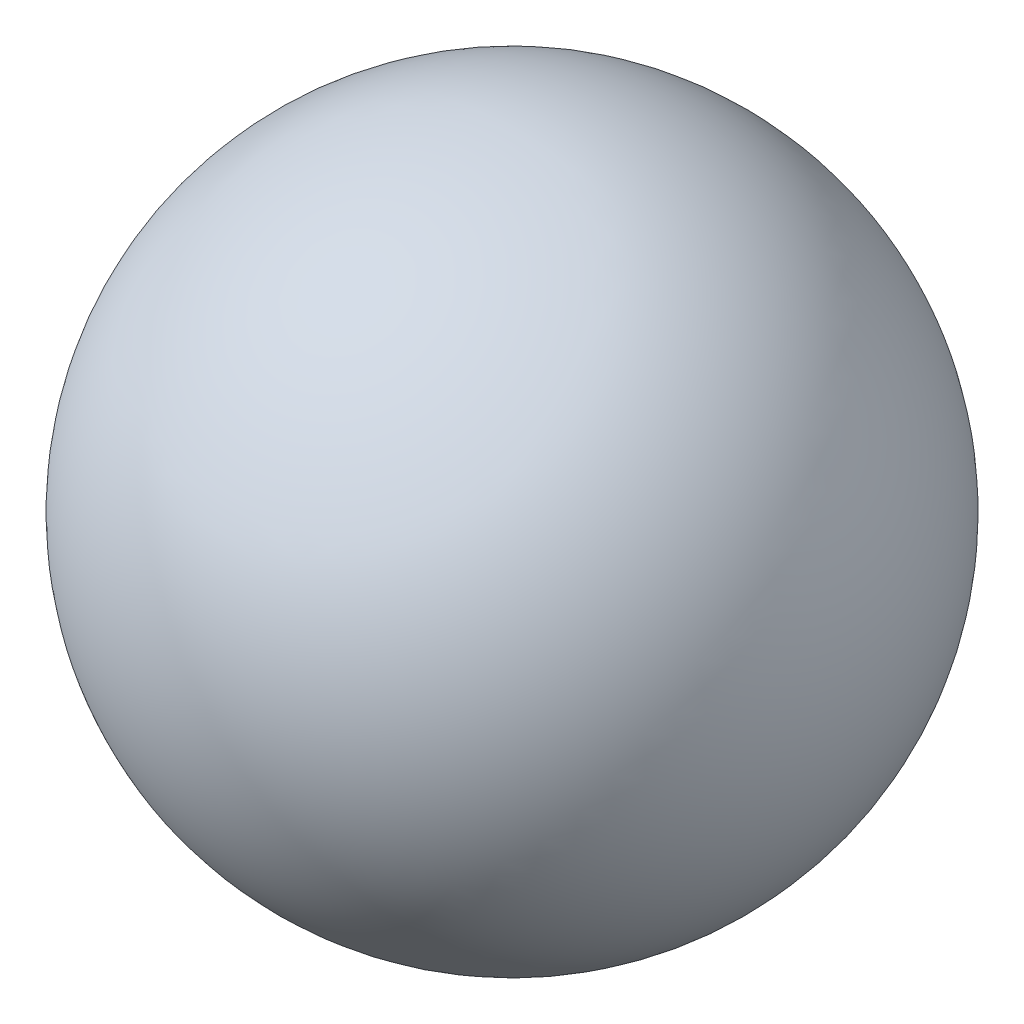
ISO-10303-21;
HEADER;
FILE_DESCRIPTION(('STEP AP214'),'2;1');
FILE_NAME('part.step','',(''),(''),'','','');
FILE_SCHEMA(('AUTOMOTIVE_DESIGN { 1 0 10303 214 1 1 1 1 }'));
ENDSEC;
DATA;
#1=APPLICATION_CONTEXT('core data for automotive mechanical design processes');
#2=APPLICATION_PROTOCOL_DEFINITION('international standard','automotive_design',2000,#1);
#3=PRODUCT_CONTEXT('',#1,'mechanical');
#4=PRODUCT('Part','Part','',(#3));
#5=PRODUCT_RELATED_PRODUCT_CATEGORY('part','',(#4));
#6=PRODUCT_DEFINITION_FORMATION('','',#4);
#7=PRODUCT_DEFINITION_CONTEXT('part definition',#1,'design');
#8=PRODUCT_DEFINITION('design','',#6,#7);
#9=PRODUCT_DEFINITION_SHAPE('','',#8);
#10=(LENGTH_UNIT() NAMED_UNIT(*) SI_UNIT(.MILLI.,.METRE.));
#11=(NAMED_UNIT(*) PLANE_ANGLE_UNIT() SI_UNIT($,.RADIAN.));
#12=(NAMED_UNIT(*) SI_UNIT($,.STERADIAN.) SOLID_ANGLE_UNIT());
#13=UNCERTAINTY_MEASURE_WITH_UNIT(LENGTH_MEASURE(1.E-05),#10,'distance_accuracy_value','');
#14=(GEOMETRIC_REPRESENTATION_CONTEXT(3) GLOBAL_UNCERTAINTY_ASSIGNED_CONTEXT((#13)) GLOBAL_UNIT_ASSIGNED_CONTEXT((#10,
#11,#12)) REPRESENTATION_CONTEXT('',''));
#15=CARTESIAN_POINT('',(0.,0.,0.));
#16=DIRECTION('',(0.,0.,1.));
#17=DIRECTION('',(1.,0.,0.));
#18=AXIS2_PLACEMENT_3D('',#15,#16,#17);
#19=CARTESIAN_POINT('',(0.,0.,0.));
#20=DIRECTION('',(0.,0.,1.));
#21=DIRECTION('',(-1.,0.,0.));
#22=AXIS2_PLACEMENT_3D('',#19,#20,#21);
#23=SPHERICAL_SURFACE('',#22,39.);
#24=CARTESIAN_POINT('',(0.,0.,-37.5599520766467));
#25=DIRECTION('',(0.,0.,1.));
#26=DIRECTION('',(1.,0.,0.));
#27=AXIS2_PLACEMENT_3D('',#24,#25,#26);
#28=CIRCLE('',#27,10.5);
#29=CARTESIAN_POINT('',(10.5,0.,-37.5599520766467));
#30=VERTEX_POINT('',#29);
#31=EDGE_CURVE('E10',#30,#30,#28,.T.);
#32=ORIENTED_EDGE('',*,*,#31,.T.);
#33=EDGE_LOOP('',(#32));
#34=FACE_BOUND('',#33,.T.);
#35=ADVANCED_FACE('F39',(#34),#23,.T.);
#36=CARTESIAN_POINT('',(0.,0.,-151.));
#37=DIRECTION('',(0.,0.,1.));
#38=DIRECTION('',(1.,0.,0.));
#39=AXIS2_PLACEMENT_3D('',#36,#37,#38);
#40=CYLINDRICAL_SURFACE('',#39,10.5);
#41=CARTESIAN_POINT('',(0.,0.,0.));
#42=DIRECTION('',(0.,0.,1.));
#43=DIRECTION('',(1.,0.,0.));
#44=AXIS2_PLACEMENT_3D('',#41,#42,#43);
#45=CIRCLE('',#44,10.5);
#46=CARTESIAN_POINT('',(10.5,0.,0.));
#47=VERTEX_POINT('',#46);
#48=EDGE_CURVE('E46',#47,#47,#45,.T.);
#49=ORIENTED_EDGE('',*,*,#48,.T.);
#50=EDGE_LOOP('',(#49));
#51=FACE_BOUND('',#50,.T.);
#52=ORIENTED_EDGE('',*,*,#31,.F.);
#53=EDGE_LOOP('',(#52));
#54=FACE_BOUND('',#53,.T.);
#55=ADVANCED_FACE('F53',(#51,#54),#40,.F.);
#56=CARTESIAN_POINT('',(0.,0.,0.));
#57=DIRECTION('',(0.,0.,1.));
#58=DIRECTION('',(1.,0.,0.));
#59=AXIS2_PLACEMENT_3D('',#56,#57,#58);
#60=PLANE('',#59);
#61=ORIENTED_EDGE('',*,*,#48,.F.);
#62=EDGE_LOOP('',(#61));
#63=FACE_BOUND('',#62,.T.);
#64=ADVANCED_FACE('F56',(#63),#60,.F.);
#65=CLOSED_SHELL('',(#35,#55,#64));
#66=MANIFOLD_SOLID_BREP('B2',#65);
#67=ADVANCED_BREP_SHAPE_REPRESENTATION('',(#18,#66),#14);
#68=SHAPE_DEFINITION_REPRESENTATION(#9,#67);
ENDSEC;
END-ISO-10303-21;
